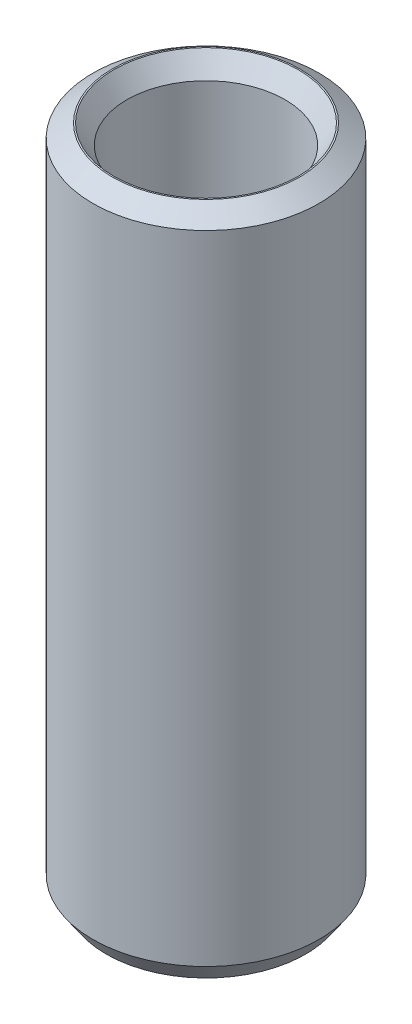
ISO-10303-21;
HEADER;
FILE_DESCRIPTION(('STEP AP214'),'2;1');
FILE_NAME('part.step','',(''),(''),'','','');
FILE_SCHEMA(('AUTOMOTIVE_DESIGN { 1 0 10303 214 1 1 1 1 }'));
ENDSEC;
DATA;
#1=APPLICATION_CONTEXT('core data for automotive mechanical design processes');
#2=APPLICATION_PROTOCOL_DEFINITION('international standard','automotive_design',2000,#1);
#3=PRODUCT_CONTEXT('',#1,'mechanical');
#4=PRODUCT('Part','Part','',(#3));
#5=PRODUCT_RELATED_PRODUCT_CATEGORY('part','',(#4));
#6=PRODUCT_DEFINITION_FORMATION('','',#4);
#7=PRODUCT_DEFINITION_CONTEXT('part definition',#1,'design');
#8=PRODUCT_DEFINITION('design','',#6,#7);
#9=PRODUCT_DEFINITION_SHAPE('','',#8);
#10=(LENGTH_UNIT() NAMED_UNIT(*) SI_UNIT(.MILLI.,.METRE.));
#11=(NAMED_UNIT(*) PLANE_ANGLE_UNIT() SI_UNIT($,.RADIAN.));
#12=(NAMED_UNIT(*) SI_UNIT($,.STERADIAN.) SOLID_ANGLE_UNIT());
#13=UNCERTAINTY_MEASURE_WITH_UNIT(LENGTH_MEASURE(1.E-05),#10,'distance_accuracy_value','');
#14=(GEOMETRIC_REPRESENTATION_CONTEXT(3) GLOBAL_UNCERTAINTY_ASSIGNED_CONTEXT((#13)) GLOBAL_UNIT_ASSIGNED_CONTEXT((#10,
#11,#12)) REPRESENTATION_CONTEXT('',''));
#15=CARTESIAN_POINT('',(0.,0.,0.));
#16=DIRECTION('',(0.,0.,1.));
#17=DIRECTION('',(1.,0.,0.));
#18=AXIS2_PLACEMENT_3D('',#15,#16,#17);
#19=CARTESIAN_POINT('',(0.,59.2707666181306,0.));
#20=DIRECTION('',(0.,-1.,0.));
#21=DIRECTION('',(0.,0.,-1.));
#22=AXIS2_PLACEMENT_3D('',#19,#20,#21);
#23=CYLINDRICAL_SURFACE('',#22,10.);
#24=CARTESIAN_POINT('',(0.,1.70794993879382,0.));
#25=DIRECTION('',(0.,1.,0.));
#26=DIRECTION('',(0.,0.,1.));
#27=AXIS2_PLACEMENT_3D('',#24,#25,#26);
#28=CIRCLE('',#27,10.);
#29=CARTESIAN_POINT('',(0.,1.70794993879382,10.));
#30=VERTEX_POINT('',#29);
#31=EDGE_CURVE('E10',#30,#30,#28,.T.);
#32=ORIENTED_EDGE('',*,*,#31,.T.);
#33=EDGE_LOOP('',(#32));
#34=FACE_BOUND('',#33,.T.);
#35=CARTESIAN_POINT('',(0.,58.0979619738302,0.));
#36=DIRECTION('',(0.,1.,0.));
#37=DIRECTION('',(0.,0.,1.));
#38=AXIS2_PLACEMENT_3D('',#35,#36,#37);
#39=CIRCLE('',#38,10.);
#40=CARTESIAN_POINT('',(0.,58.0979619738302,10.));
#41=VERTEX_POINT('',#40);
#42=EDGE_CURVE('E50',#41,#41,#39,.F.);
#43=ORIENTED_EDGE('',*,*,#42,.T.);
#44=EDGE_LOOP('',(#43));
#45=FACE_BOUND('',#44,.T.);
#46=ADVANCED_FACE('F39',(#34,#45),#23,.T.);
#47=CARTESIAN_POINT('',(0.,59.2707666181306,0.));
#48=DIRECTION('',(0.,1.,0.));
#49=DIRECTION('',(0.,0.,1.));
#50=AXIS2_PLACEMENT_3D('',#47,#48,#49);
#51=PLANE('',#50);
#52=CARTESIAN_POINT('',(0.,59.2707666181306,0.));
#53=DIRECTION('',(0.,1.,0.));
#54=DIRECTION('',(0.,0.,1.));
#55=AXIS2_PLACEMENT_3D('',#52,#53,#54);
#56=CIRCLE('',#55,8.16493536198897);
#57=CARTESIAN_POINT('',(0.,59.2707666181306,8.16493536198897));
#58=VERTEX_POINT('',#57);
#59=EDGE_CURVE('E58',#58,#58,#56,.F.);
#60=ORIENTED_EDGE('',*,*,#59,.T.);
#61=EDGE_LOOP('',(#60));
#62=FACE_BOUND('',#61,.T.);
#63=CARTESIAN_POINT('',(0.,59.2707666181306,0.));
#64=DIRECTION('',(0.,1.,0.));
#65=DIRECTION('',(0.,0.,1.));
#66=AXIS2_PLACEMENT_3D('',#63,#64,#65);
#67=CIRCLE('',#66,8.29205006120622);
#68=CARTESIAN_POINT('',(0.,59.2707666181306,8.29205006120622));
#69=VERTEX_POINT('',#68);
#70=EDGE_CURVE('E61',#69,#69,#67,.T.);
#71=ORIENTED_EDGE('',*,*,#70,.T.);
#72=EDGE_LOOP('',(#71));
#73=FACE_BOUND('',#72,.T.);
#74=ADVANCED_FACE('F88',(#62,#73),#51,.T.);
#75=CARTESIAN_POINT('',(0.,0.,0.));
#76=DIRECTION('',(0.,1.,0.));
#77=DIRECTION('',(0.,0.,1.));
#78=AXIS2_PLACEMENT_3D('',#75,#76,#77);
#79=PLANE('',#78);
#80=CARTESIAN_POINT('',(0.,0.,0.));
#81=DIRECTION('',(0.,1.,0.));
#82=DIRECTION('',(0.,0.,1.));
#83=AXIS2_PLACEMENT_3D('',#80,#81,#82);
#84=CIRCLE('',#83,8.70008065648229);
#85=CARTESIAN_POINT('',(0.,0.,8.70008065648229));
#86=VERTEX_POINT('',#85);
#87=EDGE_CURVE('E51',#86,#86,#84,.T.);
#88=ORIENTED_EDGE('',*,*,#87,.T.);
#89=EDGE_LOOP('',(#88));
#90=FACE_BOUND('',#89,.T.);
#91=CARTESIAN_POINT('',(0.,0.,0.));
#92=DIRECTION('',(0.,1.,0.));
#93=DIRECTION('',(0.,0.,1.));
#94=AXIS2_PLACEMENT_3D('',#91,#92,#93);
#95=CIRCLE('',#94,8.82719535569951);
#96=CARTESIAN_POINT('',(0.,0.,8.82719535569951));
#97=VERTEX_POINT('',#96);
#98=EDGE_CURVE('E54',#97,#97,#95,.F.);
#99=ORIENTED_EDGE('',*,*,#98,.T.);
#100=EDGE_LOOP('',(#99));
#101=FACE_BOUND('',#100,.T.);
#102=ADVANCED_FACE('F83',(#90,#101),#79,.F.);
#103=CARTESIAN_POINT('',(0.,59.2707666181306,0.));
#104=DIRECTION('',(0.,-1.,0.));
#105=DIRECTION('',(0.,0.,-1.));
#106=AXIS2_PLACEMENT_3D('',#103,#104,#105);
#107=CYLINDRICAL_SURFACE('',#106,6.99213071768848);
#108=CARTESIAN_POINT('',(0.,57.5628166793368,0.));
#109=DIRECTION('',(0.,1.,0.));
#110=DIRECTION('',(0.,0.,1.));
#111=AXIS2_PLACEMENT_3D('',#108,#109,#110);
#112=CIRCLE('',#111,6.99213071768848);
#113=CARTESIAN_POINT('',(0.,57.5628166793368,6.99213071768848));
#114=VERTEX_POINT('',#113);
#115=EDGE_CURVE('E67',#114,#114,#112,.T.);
#116=ORIENTED_EDGE('',*,*,#115,.T.);
#117=EDGE_LOOP('',(#116));
#118=FACE_BOUND('',#117,.T.);
#119=CARTESIAN_POINT('',(0.,1.17280464430048,0.));
#120=DIRECTION('',(0.,1.,0.));
#121=DIRECTION('',(0.,0.,1.));
#122=AXIS2_PLACEMENT_3D('',#119,#120,#121);
#123=CIRCLE('',#122,6.99213071768848);
#124=CARTESIAN_POINT('',(0.,1.17280464430048,6.99213071768848));
#125=VERTEX_POINT('',#124);
#126=EDGE_CURVE('E69',#125,#125,#123,.F.);
#127=ORIENTED_EDGE('',*,*,#126,.T.);
#128=EDGE_LOOP('',(#127));
#129=FACE_BOUND('',#128,.T.);
#130=ADVANCED_FACE('F71',(#118,#129),#107,.F.);
#131=CARTESIAN_POINT('',(0.,57.5628166793368,0.));
#132=DIRECTION('',(0.,1.,0.));
#133=DIRECTION('',(0.,0.,1.));
#134=AXIS2_PLACEMENT_3D('',#131,#132,#133);
#135=CONICAL_SURFACE('',#134,6.99213071768848,0.601726170152193);
#136=CARTESIAN_POINT('',(0.,59.2707666181306,8.16493536198897));
#137=CARTESIAN_POINT('',(0.,59.2529754729349,8.15271864694417));
#138=CARTESIAN_POINT('',(0.,59.2351843277391,8.14050193189938));
#139=CARTESIAN_POINT('',(0.,59.1996020373476,8.11606850180978));
#140=CARTESIAN_POINT('',(0.,59.1818108921518,8.10385178676498));
#141=CARTESIAN_POINT('',(0.,59.1462286017602,8.07941835667539));
#142=CARTESIAN_POINT('',(0.,59.1284374565645,8.06720164163059));
#143=CARTESIAN_POINT('',(0.,59.0928551661729,8.042768211541));
#144=CARTESIAN_POINT('',(0.,59.0750640209772,8.0305514964962));
#145=CARTESIAN_POINT('',(0.,59.0394817305856,8.00611806640661));
#146=CARTESIAN_POINT('',(0.,59.0216905853899,7.99390135136181));
#147=CARTESIAN_POINT('',(0.,58.9861082949983,7.96946792127222));
#148=CARTESIAN_POINT('',(0.,58.9683171498026,7.95725120622742));
#149=CARTESIAN_POINT('',(0.,58.932734859411,7.93281777613783));
#150=CARTESIAN_POINT('',(0.,58.9149437142152,7.92060106109303));
#151=CARTESIAN_POINT('',(0.,58.8793614238237,7.89616763100344));
#152=CARTESIAN_POINT('',(0.,58.8615702786279,7.88395091595864));
#153=CARTESIAN_POINT('',(0.,58.8259879882364,7.85951748586905));
#154=CARTESIAN_POINT('',(0.,58.8081968430406,7.84730077082425));
#155=CARTESIAN_POINT('',(0.,58.7726145526491,7.82286734073466));
#156=CARTESIAN_POINT('',(0.,58.7548234074533,7.81065062568986));
#157=CARTESIAN_POINT('',(0.,58.7192411170618,7.78621719560027));
#158=CARTESIAN_POINT('',(0.,58.701449971866,7.77400048055547));
#159=CARTESIAN_POINT('',(0.,58.6658676814745,7.74956705046588));
#160=CARTESIAN_POINT('',(0.,58.6480765362787,7.73735033542108));
#161=CARTESIAN_POINT('',(0.,58.6124942458872,7.71291690533149));
#162=CARTESIAN_POINT('',(0.,58.5947031006914,7.70070019028669));
#163=CARTESIAN_POINT('',(0.,58.5591208102999,7.6762667601971));
#164=CARTESIAN_POINT('',(0.,58.5413296651041,7.6640500451523));
#165=CARTESIAN_POINT('',(0.,58.5057473747126,7.63961661506271));
#166=CARTESIAN_POINT('',(0.,58.4879562295168,7.62739990001791));
#167=CARTESIAN_POINT('',(0.,58.4523739391253,7.60296646992832));
#168=CARTESIAN_POINT('',(0.,58.4345827939295,7.59074975488352));
#169=CARTESIAN_POINT('',(0.,58.399000503538,7.56631632479393));
#170=CARTESIAN_POINT('',(0.,58.3812093583422,7.55409960974913));
#171=CARTESIAN_POINT('',(0.,58.3456270679507,7.52966617965954));
#172=CARTESIAN_POINT('',(0.,58.3278359227549,7.51744946461474));
#173=CARTESIAN_POINT('',(0.,58.2922536323633,7.49301603452515));
#174=CARTESIAN_POINT('',(0.,58.2744624871676,7.48079931948035));
#175=CARTESIAN_POINT('',(0.,58.238880196776,7.45636588939076));
#176=CARTESIAN_POINT('',(0.,58.2210890515803,7.44414917434596));
#177=CARTESIAN_POINT('',(0.,58.1855067611887,7.41971574425637));
#178=CARTESIAN_POINT('',(0.,58.167715615993,7.40749902921157));
#179=CARTESIAN_POINT('',(0.,58.1321333256014,7.38306559912197));
#180=CARTESIAN_POINT('',(0.,58.1143421804057,7.37084888407718));
#181=CARTESIAN_POINT('',(0.,58.0787598900141,7.34641545398759));
#182=CARTESIAN_POINT('',(0.,58.0609687448183,7.33419873894279));
#183=CARTESIAN_POINT('',(0.,58.0253864544268,7.30976530885319));
#184=CARTESIAN_POINT('',(0.,58.007595309231,7.2975485938084));
#185=CARTESIAN_POINT('',(0.,57.9720130188395,7.2731151637188));
#186=CARTESIAN_POINT('',(0.,57.9542218736437,7.26089844867401));
#187=CARTESIAN_POINT('',(0.,57.9186395832522,7.23646501858442));
#188=CARTESIAN_POINT('',(0.,57.9008484380564,7.22424830353962));
#189=CARTESIAN_POINT('',(0.,57.8652661476649,7.19981487345002));
#190=CARTESIAN_POINT('',(0.,57.8474750024691,7.18759815840523));
#191=CARTESIAN_POINT('',(0.,57.8118927120776,7.16316472831563));
#192=CARTESIAN_POINT('',(0.,57.7941015668818,7.15094801327084));
#193=CARTESIAN_POINT('',(0.,57.7585192764903,7.12651458318124));
#194=CARTESIAN_POINT('',(0.,57.7407281312945,7.11429786813645));
#195=CARTESIAN_POINT('',(0.,57.705145840903,7.08986443804685));
#196=CARTESIAN_POINT('',(0.,57.6873546957072,7.07764772300206));
#197=CARTESIAN_POINT('',(0.,57.6517724053157,7.05321429291246));
#198=CARTESIAN_POINT('',(0.,57.6339812601199,7.04099757786767));
#199=CARTESIAN_POINT('',(0.,57.5983989697284,7.01656414777807));
#200=CARTESIAN_POINT('',(0.,57.5806078245326,7.00434743273328));
#201=CARTESIAN_POINT('',(0.,57.5628166793368,6.99213071768848));
#202=B_SPLINE_CURVE_WITH_KNOTS('',3,(#136,#137,#138,#139,#140,#141,#142,#143,#144,#145,#146,
#147,#148,#149,#150,#151,#152,#153,#154,#155,#156,#157,#158,#159,#160,#161,#162,#163,#164,#165,
#166,#167,#168,#169,#170,#171,#172,#173,#174,#175,#176,#177,#178,#179,#180,#181,#182,#183,#184,
#185,#186,#187,#188,#189,#190,#191,#192,#193,#194,#195,#196,#197,#198,#199,#200,#201),
.UNSPECIFIED.,.F.,.F.,(4,2,2,2,2,2,2,2,2,2,2,2,2,2,2,2,2,2,2,2,2,2,2,2,2,2,2,2,2,2,2,2,4),(0.,
0.0647453223388696,0.129490644677738,0.194235967016607,0.258981289355482,0.323726611694351,
0.38847193403322,0.453217256372095,0.517962578710964,0.582707901049832,0.647453223388701,
0.712198545727576,0.776943868066445,0.841689190405314,0.906434512744183,0.971179835083058,
1.03592515742193,1.1006704797608,1.16541580209967,1.23016112443854,1.29490644677741,
1.35965176911628,1.42439709145515,1.48914241379402,1.55388773613289,1.61863305847176,
1.68337838081063,1.7481237031495,1.81286902548837,1.87761434782725,1.94235967016611,
2.00710499250498,2.07185031484385),.UNSPECIFIED.);
#203=EDGE_CURVE('BSEAM77',#58,#114,#202,.T.);
#204=ORIENTED_EDGE('',*,*,#59,.F.);
#205=ORIENTED_EDGE('',*,*,#115,.F.);
#206=ORIENTED_EDGE('',*,*,#203,.T.);
#207=ORIENTED_EDGE('',*,*,#203,.F.);
#208=EDGE_LOOP('',(#204,#206,#205,#207));
#209=FACE_BOUND('',#208,.T.);
#210=ADVANCED_FACE('F77',(#209),#135,.F.);
#211=CARTESIAN_POINT('',(0.,0.,0.));
#212=DIRECTION('',(0.,-1.,0.));
#213=DIRECTION('',(0.,0.,-1.));
#214=AXIS2_PLACEMENT_3D('',#211,#212,#213);
#215=CONICAL_SURFACE('',#214,8.70008065648229,0.969070156642707);
#216=ORIENTED_EDGE('',*,*,#126,.F.);
#217=EDGE_LOOP('',(#216));
#218=FACE_BOUND('',#217,.T.);
#219=ORIENTED_EDGE('',*,*,#87,.F.);
#220=EDGE_LOOP('',(#219));
#221=FACE_BOUND('',#220,.T.);
#222=ADVANCED_FACE('F73',(#218,#221),#215,.F.);
#223=CARTESIAN_POINT('',(0.,1.70794993879382,0.));
#224=DIRECTION('',(0.,1.,0.));
#225=DIRECTION('',(0.,0.,1.));
#226=AXIS2_PLACEMENT_3D('',#223,#224,#225);
#227=CONICAL_SURFACE('',#226,10.,0.601726170152192);
#228=CARTESIAN_POINT('',(0.,0.,8.82719535569951));
#229=CARTESIAN_POINT('',(0.,0.0177911451957691,8.83941207074431));
#230=CARTESIAN_POINT('',(0.,0.035582290391538,8.8516287857891));
#231=CARTESIAN_POINT('',(0.,0.0711645807830757,8.8760622158787));
#232=CARTESIAN_POINT('',(0.,0.0889557259788445,8.88827893092349));
#233=CARTESIAN_POINT('',(0.,0.124538016370382,8.91271236101309));
#234=CARTESIAN_POINT('',(0.,0.142329161566151,8.92492907605788));
#235=CARTESIAN_POINT('',(0.,0.177911451957689,8.94936250614748));
#236=CARTESIAN_POINT('',(0.,0.195702597153458,8.96157922119227));
#237=CARTESIAN_POINT('',(0.,0.231284887544996,8.98601265128187));
#238=CARTESIAN_POINT('',(0.,0.249076032740765,8.99822936632666));
#239=CARTESIAN_POINT('',(0.,0.284658323132303,9.02266279641626));
#240=CARTESIAN_POINT('',(0.,0.302449468328072,9.03487951146105));
#241=CARTESIAN_POINT('',(0.,0.33803175871961,9.05931294155065));
#242=CARTESIAN_POINT('',(0.,0.355822903915379,9.07152965659544));
#243=CARTESIAN_POINT('',(0.,0.391405194306917,9.09596308668504));
#244=CARTESIAN_POINT('',(0.,0.409196339502686,9.10817980172984));
#245=CARTESIAN_POINT('',(0.,0.444778629894224,9.13261323181943));
#246=CARTESIAN_POINT('',(0.,0.462569775089993,9.14482994686423));
#247=CARTESIAN_POINT('',(0.,0.498152065481531,9.16926337695382));
#248=CARTESIAN_POINT('',(0.,0.5159432106773,9.18148009199862));
#249=CARTESIAN_POINT('',(0.,0.551525501068838,9.20591352208821));
#250=CARTESIAN_POINT('',(0.,0.569316646264607,9.21813023713301));
#251=CARTESIAN_POINT('',(0.,0.604898936656144,9.2425636672226));
#252=CARTESIAN_POINT('',(0.,0.622690081851913,9.2547803822674));
#253=CARTESIAN_POINT('',(0.,0.658272372243452,9.27921381235699));
#254=CARTESIAN_POINT('',(0.,0.676063517439221,9.29143052740179));
#255=CARTESIAN_POINT('',(0.,0.711645807830759,9.31586395749138));
#256=CARTESIAN_POINT('',(0.,0.729436953026527,9.32808067253618));
#257=CARTESIAN_POINT('',(0.,0.765019243418065,9.35251410262577));
#258=CARTESIAN_POINT('',(0.,0.782810388613834,9.36473081767057));
#259=CARTESIAN_POINT('',(0.,0.818392679005372,9.38916424776016));
#260=CARTESIAN_POINT('',(0.,0.836183824201141,9.40138096280496));
#261=CARTESIAN_POINT('',(0.,0.871766114592679,9.42581439289455));
#262=CARTESIAN_POINT('',(0.,0.889557259788448,9.43803110793935));
#263=CARTESIAN_POINT('',(0.,0.925139550179986,9.46246453802894));
#264=CARTESIAN_POINT('',(0.,0.942930695375755,9.47468125307374));
#265=CARTESIAN_POINT('',(0.,0.978512985767293,9.49911468316333));
#266=CARTESIAN_POINT('',(0.,0.996304130963062,9.51133139820813));
#267=CARTESIAN_POINT('',(0.,1.0318864213546,9.53576482829772));
#268=CARTESIAN_POINT('',(0.,1.04967756655037,9.54798154334252));
#269=CARTESIAN_POINT('',(0.,1.08525985694191,9.57241497343211));
#270=CARTESIAN_POINT('',(0.,1.10305100213768,9.58463168847691));
#271=CARTESIAN_POINT('',(0.,1.13863329252921,9.6090651185665));
#272=CARTESIAN_POINT('',(0.,1.15642443772498,9.6212818336113));
#273=CARTESIAN_POINT('',(0.,1.19200672811652,9.64571526370089));
#274=CARTESIAN_POINT('',(0.,1.20979787331229,9.65793197874569));
#275=CARTESIAN_POINT('',(0.,1.24538016370383,9.68236540883528));
#276=CARTESIAN_POINT('',(0.,1.2631713088996,9.69458212388008));
#277=CARTESIAN_POINT('',(0.,1.29875359929113,9.71901555396967));
#278=CARTESIAN_POINT('',(0.,1.3165447444869,9.73123226901447));
#279=CARTESIAN_POINT('',(0.,1.35212703487844,9.75566569910407));
#280=CARTESIAN_POINT('',(0.,1.36991818007421,9.76788241414886));
#281=CARTESIAN_POINT('',(0.,1.40550047046575,9.79231584423846));
#282=CARTESIAN_POINT('',(0.,1.42329161566152,9.80453255928325));
#283=CARTESIAN_POINT('',(0.,1.45887390605306,9.82896598937285));
#284=CARTESIAN_POINT('',(0.,1.47666505124882,9.84118270441764));
#285=CARTESIAN_POINT('',(0.,1.51224734164036,9.86561613450724));
#286=CARTESIAN_POINT('',(0.,1.53003848683613,9.87783284955203));
#287=CARTESIAN_POINT('',(0.,1.56562077722767,9.90226627964163));
#288=CARTESIAN_POINT('',(0.,1.58341192242344,9.91448299468642));
#289=CARTESIAN_POINT('',(0.,1.61899421281498,9.93891642477602));
#290=CARTESIAN_POINT('',(0.,1.63678535801074,9.95113313982081));
#291=CARTESIAN_POINT('',(0.,1.67236764840228,9.97556656991041));
#292=CARTESIAN_POINT('',(0.,1.69015879359805,9.9877832849552));
#293=CARTESIAN_POINT('',(0.,1.70794993879382,10.));
#294=B_SPLINE_CURVE_WITH_KNOTS('',3,(#228,#229,#230,#231,#232,#233,#234,#235,#236,#237,#238,
#239,#240,#241,#242,#243,#244,#245,#246,#247,#248,#249,#250,#251,#252,#253,#254,#255,#256,#257,
#258,#259,#260,#261,#262,#263,#264,#265,#266,#267,#268,#269,#270,#271,#272,#273,#274,#275,#276,
#277,#278,#279,#280,#281,#282,#283,#284,#285,#286,#287,#288,#289,#290,#291,#292,#293),
.UNSPECIFIED.,.F.,.F.,(4,2,2,2,2,2,2,2,2,2,2,2,2,2,2,2,2,2,2,2,2,2,2,2,2,2,2,2,2,2,2,2,4),(0.,
0.0647453223388704,0.129490644677742,0.194235967016612,0.258981289355483,0.323726611694353,
0.388471934033225,0.453217256372095,0.517962578710967,0.582707901049837,0.647453223388707,
0.712198545727579,0.776943868066449,0.841689190405319,0.906434512744191,0.971179835083061,
1.03592515742193,1.1006704797608,1.16541580209967,1.23016112443854,1.29490644677742,
1.35965176911629,1.42439709145516,1.48914241379403,1.5538877361329,1.61863305847177,
1.68337838081064,1.74812370314951,1.81286902548838,1.87761434782725,1.94235967016612,
2.00710499250499,2.07185031484386),.UNSPECIFIED.);
#295=EDGE_CURVE('BSEAM76',#97,#30,#294,.T.);
#296=ORIENTED_EDGE('',*,*,#98,.F.);
#297=ORIENTED_EDGE('',*,*,#31,.F.);
#298=ORIENTED_EDGE('',*,*,#295,.T.);
#299=ORIENTED_EDGE('',*,*,#295,.F.);
#300=EDGE_LOOP('',(#296,#298,#297,#299));
#301=FACE_BOUND('',#300,.T.);
#302=ADVANCED_FACE('F76',(#301),#227,.T.);
#303=CARTESIAN_POINT('',(0.,59.2707666181306,0.));
#304=DIRECTION('',(0.,-1.,0.));
#305=DIRECTION('',(0.,0.,-1.));
#306=AXIS2_PLACEMENT_3D('',#303,#304,#305);
#307=CONICAL_SURFACE('',#306,8.29205006120622,0.969070156642706);
#308=ORIENTED_EDGE('',*,*,#42,.F.);
#309=EDGE_LOOP('',(#308));
#310=FACE_BOUND('',#309,.T.);
#311=ORIENTED_EDGE('',*,*,#70,.F.);
#312=EDGE_LOOP('',(#311));
#313=FACE_BOUND('',#312,.T.);
#314=ADVANCED_FACE('F45',(#310,#313),#307,.T.);
#315=CLOSED_SHELL('',(#46,#74,#102,#130,#210,#222,#302,#314));
#316=MANIFOLD_SOLID_BREP('B2',#315);
#317=ADVANCED_BREP_SHAPE_REPRESENTATION('',(#18,#316),#14);
#318=SHAPE_DEFINITION_REPRESENTATION(#9,#317);
ENDSEC;
END-ISO-10303-21;
